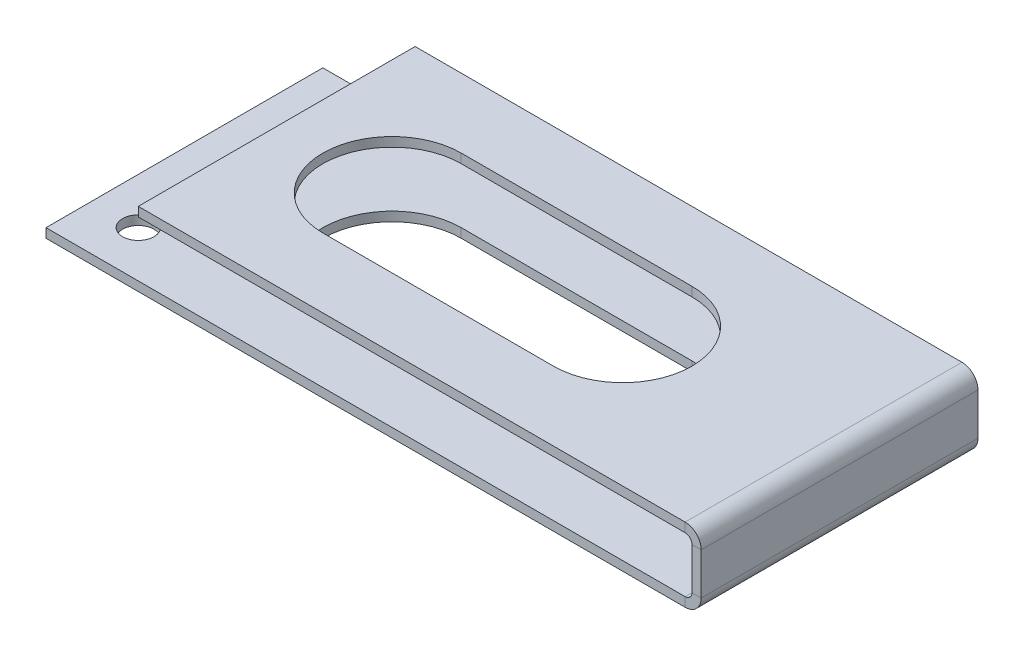
ISO-10303-21;
HEADER;
FILE_DESCRIPTION(('STEP AP214'),'2;1');
FILE_NAME('part.step','',(''),(''),'','','');
FILE_SCHEMA(('AUTOMOTIVE_DESIGN { 1 0 10303 214 1 1 1 1 }'));
ENDSEC;
DATA;
#1=APPLICATION_CONTEXT('core data for automotive mechanical design processes');
#2=APPLICATION_PROTOCOL_DEFINITION('international standard','automotive_design',2000,#1);
#3=PRODUCT_CONTEXT('',#1,'mechanical');
#4=PRODUCT('Part','Part','',(#3));
#5=PRODUCT_RELATED_PRODUCT_CATEGORY('part','',(#4));
#6=PRODUCT_DEFINITION_FORMATION('','',#4);
#7=PRODUCT_DEFINITION_CONTEXT('part definition',#1,'design');
#8=PRODUCT_DEFINITION('design','',#6,#7);
#9=PRODUCT_DEFINITION_SHAPE('','',#8);
#10=(LENGTH_UNIT() NAMED_UNIT(*) SI_UNIT(.MILLI.,.METRE.));
#11=(NAMED_UNIT(*) PLANE_ANGLE_UNIT() SI_UNIT($,.RADIAN.));
#12=(NAMED_UNIT(*) SI_UNIT($,.STERADIAN.) SOLID_ANGLE_UNIT());
#13=UNCERTAINTY_MEASURE_WITH_UNIT(LENGTH_MEASURE(1.E-05),#10,'distance_accuracy_value','');
#14=(GEOMETRIC_REPRESENTATION_CONTEXT(3) GLOBAL_UNCERTAINTY_ASSIGNED_CONTEXT((#13)) GLOBAL_UNIT_ASSIGNED_CONTEXT((#10,
#11,#12)) REPRESENTATION_CONTEXT('',''));
#15=CARTESIAN_POINT('',(0.,0.,0.));
#16=DIRECTION('',(0.,0.,1.));
#17=DIRECTION('',(1.,0.,0.));
#18=AXIS2_PLACEMENT_3D('',#15,#16,#17);
#19=CARTESIAN_POINT('',(31.,-7.,15.));
#20=DIRECTION('',(0.,0.,-1.));
#21=DIRECTION('',(0.,1.,0.));
#22=AXIS2_PLACEMENT_3D('',#19,#20,#21);
#23=PLANE('',#22);
#24=DIRECTION('',(1.,0.,0.));
#25=VECTOR('',#24,1.);
#26=CARTESIAN_POINT('',(30.,-6.26340000000001,15.));
#27=LINE('',#26,#25);
#28=CARTESIAN_POINT('',(30.,-6.26340000000001,15.));
#29=VERTEX_POINT('',#28);
#30=CARTESIAN_POINT('',(31.,-6.2634,15.));
#31=VERTEX_POINT('',#30);
#32=EDGE_CURVE('E274',#29,#31,#27,.T.);
#33=ORIENTED_EDGE('',*,*,#32,.T.);
#34=DIRECTION('',(0.,-1.,0.));
#35=VECTOR('',#34,1.);
#36=CARTESIAN_POINT('',(31.,-7.,15.));
#37=LINE('',#36,#35);
#38=CARTESIAN_POINT('',(31.,-1.73659999999999,15.));
#39=VERTEX_POINT('',#38);
#40=EDGE_CURVE('E302',#39,#31,#37,.T.);
#41=ORIENTED_EDGE('',*,*,#40,.F.);
#42=DIRECTION('',(1.,0.,0.));
#43=VECTOR('',#42,1.);
#44=CARTESIAN_POINT('',(30.,-1.7366,15.));
#45=LINE('',#44,#43);
#46=CARTESIAN_POINT('',(30.,-1.7366,15.));
#47=VERTEX_POINT('',#46);
#48=EDGE_CURVE('E293',#47,#39,#45,.T.);
#49=ORIENTED_EDGE('',*,*,#48,.F.);
#50=DIRECTION('',(0.,-1.,0.));
#51=VECTOR('',#50,1.);
#52=CARTESIAN_POINT('',(30.,-7.,15.));
#53=LINE('',#52,#51);
#54=EDGE_CURVE('E301',#47,#29,#53,.T.);
#55=ORIENTED_EDGE('',*,*,#54,.T.);
#56=EDGE_LOOP('',(#33,#41,#49,#55));
#57=FACE_BOUND('',#56,.T.);
#58=ADVANCED_FACE('F41',(#57),#23,.F.);
#59=CARTESIAN_POINT('',(31.,-0.999999999999997,-15.));
#60=DIRECTION('',(0.,0.,1.));
#61=DIRECTION('',(0.,-1.,0.));
#62=AXIS2_PLACEMENT_3D('',#59,#60,#61);
#63=PLANE('',#62);
#64=DIRECTION('',(1.,0.,0.));
#65=VECTOR('',#64,1.);
#66=CARTESIAN_POINT('',(30.,-6.26340000000001,-15.));
#67=LINE('',#66,#65);
#68=CARTESIAN_POINT('',(30.,-6.26340000000001,-15.));
#69=VERTEX_POINT('',#68);
#70=CARTESIAN_POINT('',(31.,-6.2634,-15.));
#71=VERTEX_POINT('',#70);
#72=EDGE_CURVE('E285',#69,#71,#67,.T.);
#73=ORIENTED_EDGE('',*,*,#72,.F.);
#74=DIRECTION('',(0.,1.,0.));
#75=VECTOR('',#74,1.);
#76=CARTESIAN_POINT('',(30.,-1.,-15.));
#77=LINE('',#76,#75);
#78=CARTESIAN_POINT('',(30.,-1.7366,-15.));
#79=VERTEX_POINT('',#78);
#80=EDGE_CURVE('E305',#69,#79,#77,.T.);
#81=ORIENTED_EDGE('',*,*,#80,.T.);
#82=DIRECTION('',(1.,0.,0.));
#83=VECTOR('',#82,1.);
#84=CARTESIAN_POINT('',(30.,-1.7366,-15.));
#85=LINE('',#84,#83);
#86=CARTESIAN_POINT('',(31.,-1.73659999999999,-15.));
#87=VERTEX_POINT('',#86);
#88=EDGE_CURVE('E288',#79,#87,#85,.T.);
#89=ORIENTED_EDGE('',*,*,#88,.T.);
#90=DIRECTION('',(0.,1.,0.));
#91=VECTOR('',#90,1.);
#92=CARTESIAN_POINT('',(31.,-0.999999999999997,-15.));
#93=LINE('',#92,#91);
#94=EDGE_CURVE('E304',#71,#87,#93,.T.);
#95=ORIENTED_EDGE('',*,*,#94,.F.);
#96=EDGE_LOOP('',(#73,#81,#89,#95));
#97=FACE_BOUND('',#96,.T.);
#98=ADVANCED_FACE('F380',(#97),#63,.F.);
#99=CARTESIAN_POINT('',(31.,1.07574889897452E-13,0.));
#100=DIRECTION('',(-1.,0.,0.));
#101=DIRECTION('',(0.,-1.,0.));
#102=AXIS2_PLACEMENT_3D('',#99,#100,#101);
#103=PLANE('',#102);
#104=DIRECTION('',(0.,0.,1.));
#105=VECTOR('',#104,1.);
#106=CARTESIAN_POINT('',(31.,-6.2634,15.));
#107=LINE('',#106,#105);
#108=EDGE_CURVE('E268',#31,#71,#107,.F.);
#109=ORIENTED_EDGE('',*,*,#108,.T.);
#110=ORIENTED_EDGE('',*,*,#94,.T.);
#111=DIRECTION('',(0.,0.,-1.));
#112=VECTOR('',#111,1.);
#113=CARTESIAN_POINT('',(31.,-1.73659999999999,0.));
#114=LINE('',#113,#112);
#115=EDGE_CURVE('E296',#39,#87,#114,.T.);
#116=ORIENTED_EDGE('',*,*,#115,.F.);
#117=ORIENTED_EDGE('',*,*,#40,.T.);
#118=EDGE_LOOP('',(#109,#110,#116,#117));
#119=FACE_BOUND('',#118,.T.);
#120=ADVANCED_FACE('F386',(#119),#103,.F.);
#121=CARTESIAN_POINT('',(30.,1.04083408558608E-13,0.));
#122=DIRECTION('',(-1.,0.,0.));
#123=DIRECTION('',(0.,-1.,0.));
#124=AXIS2_PLACEMENT_3D('',#121,#122,#123);
#125=PLANE('',#124);
#126=ORIENTED_EDGE('',*,*,#80,.F.);
#127=DIRECTION('',(0.,0.,1.));
#128=VECTOR('',#127,1.);
#129=CARTESIAN_POINT('',(30.,-6.26340000000001,15.));
#130=LINE('',#129,#128);
#131=EDGE_CURVE('E280',#29,#69,#130,.F.);
#132=ORIENTED_EDGE('',*,*,#131,.F.);
#133=ORIENTED_EDGE('',*,*,#54,.F.);
#134=DIRECTION('',(0.,0.,1.));
#135=VECTOR('',#134,1.);
#136=CARTESIAN_POINT('',(30.,-1.7366,-15.));
#137=LINE('',#136,#135);
#138=EDGE_CURVE('E291',#79,#47,#137,.T.);
#139=ORIENTED_EDGE('',*,*,#138,.F.);
#140=EDGE_LOOP('',(#126,#132,#133,#139));
#141=FACE_BOUND('',#140,.T.);
#142=ADVANCED_FACE('F419',(#141),#125,.T.);
#143=CARTESIAN_POINT('',(-30.,-1.,15.));
#144=DIRECTION('',(0.,0.,1.));
#145=DIRECTION('',(1.,0.,0.));
#146=AXIS2_PLACEMENT_3D('',#143,#144,#145);
#147=PLANE('',#146);
#148=DIRECTION('',(1.,0.,0.));
#149=VECTOR('',#148,1.);
#150=CARTESIAN_POINT('',(-30.,-1.,15.));
#151=LINE('',#150,#149);
#152=CARTESIAN_POINT('',(-30.,-1.,15.));
#153=VERTEX_POINT('',#152);
#154=CARTESIAN_POINT('',(29.2634,-1.,15.));
#155=VERTEX_POINT('',#154);
#156=EDGE_CURVE('E339',#153,#155,#151,.T.);
#157=ORIENTED_EDGE('',*,*,#156,.T.);
#158=DIRECTION('',(0.,1.,0.));
#159=VECTOR('',#158,1.);
#160=CARTESIAN_POINT('',(29.2634,-1.,15.));
#161=LINE('',#160,#159);
#162=CARTESIAN_POINT('',(29.2634,0.,15.));
#163=VERTEX_POINT('',#162);
#164=EDGE_CURVE('E317',#155,#163,#161,.T.);
#165=ORIENTED_EDGE('',*,*,#164,.T.);
#166=DIRECTION('',(1.,0.,0.));
#167=VECTOR('',#166,1.);
#168=CARTESIAN_POINT('',(-30.,0.,15.));
#169=LINE('',#168,#167);
#170=CARTESIAN_POINT('',(-30.,0.,15.));
#171=VERTEX_POINT('',#170);
#172=EDGE_CURVE('E336',#171,#163,#169,.T.);
#173=ORIENTED_EDGE('',*,*,#172,.F.);
#174=DIRECTION('',(0.,1.,0.));
#175=VECTOR('',#174,1.);
#176=CARTESIAN_POINT('',(-30.,-1.,15.));
#177=LINE('',#176,#175);
#178=EDGE_CURVE('E349',#153,#171,#177,.T.);
#179=ORIENTED_EDGE('',*,*,#178,.F.);
#180=EDGE_LOOP('',(#157,#165,#173,#179));
#181=FACE_BOUND('',#180,.T.);
#182=ADVANCED_FACE('F412',(#181),#147,.T.);
#183=CARTESIAN_POINT('',(0.,-1.,0.));
#184=DIRECTION('',(0.,-1.,0.));
#185=DIRECTION('',(0.,0.,-1.));
#186=AXIS2_PLACEMENT_3D('',#183,#184,#185);
#187=PLANE('',#186);
#188=CARTESIAN_POINT('',(-17.5,-1.,0.));
#189=DIRECTION('',(0.,-1.,0.));
#190=DIRECTION('',(0.,0.,-1.));
#191=AXIS2_PLACEMENT_3D('',#188,#189,#190);
#192=CIRCLE('',#191,7.5);
#193=CARTESIAN_POINT('',(-17.5,-1.,7.5));
#194=VERTEX_POINT('',#193);
#195=CARTESIAN_POINT('',(-17.5,-1.,-7.5));
#196=VERTEX_POINT('',#195);
#197=EDGE_CURVE('E235',#194,#196,#192,.T.);
#198=ORIENTED_EDGE('',*,*,#197,.F.);
#199=DIRECTION('',(-1.,0.,0.));
#200=VECTOR('',#199,1.);
#201=CARTESIAN_POINT('',(0.,-1.,7.5));
#202=LINE('',#201,#200);
#203=CARTESIAN_POINT('',(7.5,-1.,7.5));
#204=VERTEX_POINT('',#203);
#205=EDGE_CURVE('E223',#204,#194,#202,.T.);
#206=ORIENTED_EDGE('',*,*,#205,.F.);
#207=CARTESIAN_POINT('',(7.5,-1.,0.));
#208=DIRECTION('',(0.,-1.,0.));
#209=DIRECTION('',(0.,0.,-1.));
#210=AXIS2_PLACEMENT_3D('',#207,#208,#209);
#211=CIRCLE('',#210,7.5);
#212=CARTESIAN_POINT('',(7.5,-1.,-7.5));
#213=VERTEX_POINT('',#212);
#214=EDGE_CURVE('E231',#213,#204,#211,.T.);
#215=ORIENTED_EDGE('',*,*,#214,.F.);
#216=DIRECTION('',(1.,0.,0.));
#217=VECTOR('',#216,1.);
#218=CARTESIAN_POINT('',(0.,-1.,-7.5));
#219=LINE('',#218,#217);
#220=EDGE_CURVE('E233',#196,#213,#219,.T.);
#221=ORIENTED_EDGE('',*,*,#220,.F.);
#222=EDGE_LOOP('',(#198,#206,#215,#221));
#223=FACE_BOUND('',#222,.T.);
#224=DIRECTION('',(-1.,0.,0.));
#225=VECTOR('',#224,1.);
#226=CARTESIAN_POINT('',(-30.,-1.,-15.));
#227=LINE('',#226,#225);
#228=CARTESIAN_POINT('',(29.2634,-1.,-15.));
#229=VERTEX_POINT('',#228);
#230=CARTESIAN_POINT('',(-30.,-1.,-15.));
#231=VERTEX_POINT('',#230);
#232=EDGE_CURVE('E333',#229,#231,#227,.T.);
#233=ORIENTED_EDGE('',*,*,#232,.F.);
#234=DIRECTION('',(0.,0.,1.));
#235=VECTOR('',#234,1.);
#236=CARTESIAN_POINT('',(29.2634,-1.,15.));
#237=LINE('',#236,#235);
#238=EDGE_CURVE('E323',#155,#229,#237,.F.);
#239=ORIENTED_EDGE('',*,*,#238,.F.);
#240=ORIENTED_EDGE('',*,*,#156,.F.);
#241=DIRECTION('',(0.,0.,1.));
#242=VECTOR('',#241,1.);
#243=CARTESIAN_POINT('',(-30.,-1.,15.));
#244=LINE('',#243,#242);
#245=EDGE_CURVE('E335',#231,#153,#244,.T.);
#246=ORIENTED_EDGE('',*,*,#245,.F.);
#247=EDGE_LOOP('',(#233,#239,#240,#246));
#248=FACE_BOUND('',#247,.T.);
#249=ADVANCED_FACE('F408',(#223,#248),#187,.T.);
#250=CARTESIAN_POINT('',(0.,0.,0.));
#251=DIRECTION('',(0.,-1.,0.));
#252=DIRECTION('',(0.,0.,-1.));
#253=AXIS2_PLACEMENT_3D('',#250,#251,#252);
#254=PLANE('',#253);
#255=DIRECTION('',(1.,0.,0.));
#256=VECTOR('',#255,1.);
#257=CARTESIAN_POINT('',(-17.5,0.,7.5));
#258=LINE('',#257,#256);
#259=CARTESIAN_POINT('',(-17.5,0.,7.5));
#260=VERTEX_POINT('',#259);
#261=CARTESIAN_POINT('',(7.5,0.,7.5));
#262=VERTEX_POINT('',#261);
#263=EDGE_CURVE('E216',#260,#262,#258,.T.);
#264=ORIENTED_EDGE('',*,*,#263,.F.);
#265=CARTESIAN_POINT('',(-17.5,0.,0.));
#266=DIRECTION('',(0.,1.,0.));
#267=DIRECTION('',(0.,0.,1.));
#268=AXIS2_PLACEMENT_3D('',#265,#266,#267);
#269=CIRCLE('',#268,7.5);
#270=CARTESIAN_POINT('',(-17.5,0.,-7.5));
#271=VERTEX_POINT('',#270);
#272=EDGE_CURVE('E64',#271,#260,#269,.T.);
#273=ORIENTED_EDGE('',*,*,#272,.F.);
#274=DIRECTION('',(-1.,0.,0.));
#275=VECTOR('',#274,1.);
#276=CARTESIAN_POINT('',(-17.5,0.,-7.5));
#277=LINE('',#276,#275);
#278=CARTESIAN_POINT('',(7.5,0.,-7.5));
#279=VERTEX_POINT('',#278);
#280=EDGE_CURVE('E204',#279,#271,#277,.T.);
#281=ORIENTED_EDGE('',*,*,#280,.F.);
#282=CARTESIAN_POINT('',(7.5,0.,0.));
#283=DIRECTION('',(0.,1.,0.));
#284=DIRECTION('',(0.,0.,1.));
#285=AXIS2_PLACEMENT_3D('',#282,#283,#284);
#286=CIRCLE('',#285,7.5);
#287=EDGE_CURVE('E207',#262,#279,#286,.T.);
#288=ORIENTED_EDGE('',*,*,#287,.F.);
#289=EDGE_LOOP('',(#264,#273,#281,#288));
#290=FACE_BOUND('',#289,.T.);
#291=DIRECTION('',(0.,0.,1.));
#292=VECTOR('',#291,1.);
#293=CARTESIAN_POINT('',(29.2634,0.,15.));
#294=LINE('',#293,#292);
#295=CARTESIAN_POINT('',(29.2634,0.,-15.));
#296=VERTEX_POINT('',#295);
#297=EDGE_CURVE('E311',#163,#296,#294,.F.);
#298=ORIENTED_EDGE('',*,*,#297,.T.);
#299=DIRECTION('',(-1.,0.,0.));
#300=VECTOR('',#299,1.);
#301=CARTESIAN_POINT('',(-30.,0.,-15.));
#302=LINE('',#301,#300);
#303=CARTESIAN_POINT('',(-30.,0.,-15.));
#304=VERTEX_POINT('',#303);
#305=EDGE_CURVE('E331',#296,#304,#302,.T.);
#306=ORIENTED_EDGE('',*,*,#305,.T.);
#307=DIRECTION('',(0.,0.,1.));
#308=VECTOR('',#307,1.);
#309=CARTESIAN_POINT('',(-30.,0.,15.));
#310=LINE('',#309,#308);
#311=EDGE_CURVE('E344',#304,#171,#310,.T.);
#312=ORIENTED_EDGE('',*,*,#311,.T.);
#313=ORIENTED_EDGE('',*,*,#172,.T.);
#314=EDGE_LOOP('',(#298,#306,#312,#313));
#315=FACE_BOUND('',#314,.T.);
#316=ADVANCED_FACE('F411',(#290,#315),#254,.F.);
#317=CARTESIAN_POINT('',(-30.,-1.,15.));
#318=DIRECTION('',(-1.,0.,0.));
#319=DIRECTION('',(0.,0.,1.));
#320=AXIS2_PLACEMENT_3D('',#317,#318,#319);
#321=PLANE('',#320);
#322=ORIENTED_EDGE('',*,*,#311,.F.);
#323=DIRECTION('',(0.,1.,0.));
#324=VECTOR('',#323,1.);
#325=CARTESIAN_POINT('',(-30.,-1.,-15.));
#326=LINE('',#325,#324);
#327=EDGE_CURVE('E342',#231,#304,#326,.T.);
#328=ORIENTED_EDGE('',*,*,#327,.F.);
#329=ORIENTED_EDGE('',*,*,#245,.T.);
#330=ORIENTED_EDGE('',*,*,#178,.T.);
#331=EDGE_LOOP('',(#322,#328,#329,#330));
#332=FACE_BOUND('',#331,.T.);
#333=ADVANCED_FACE('F416',(#332),#321,.T.);
#334=CARTESIAN_POINT('',(-30.,-1.,-15.));
#335=DIRECTION('',(0.,0.,-1.));
#336=DIRECTION('',(-1.,0.,0.));
#337=AXIS2_PLACEMENT_3D('',#334,#335,#336);
#338=PLANE('',#337);
#339=DIRECTION('',(0.,1.,0.));
#340=VECTOR('',#339,1.);
#341=CARTESIAN_POINT('',(29.2634,-1.,-15.));
#342=LINE('',#341,#340);
#343=EDGE_CURVE('E328',#229,#296,#342,.T.);
#344=ORIENTED_EDGE('',*,*,#343,.F.);
#345=ORIENTED_EDGE('',*,*,#232,.T.);
#346=ORIENTED_EDGE('',*,*,#327,.T.);
#347=ORIENTED_EDGE('',*,*,#305,.F.);
#348=EDGE_LOOP('',(#344,#345,#346,#347));
#349=FACE_BOUND('',#348,.T.);
#350=ADVANCED_FACE('F43',(#349),#338,.T.);
#351=CARTESIAN_POINT('',(29.2634,-1.7366,-15.));
#352=DIRECTION('',(0.,0.,-1.));
#353=DIRECTION('',(-1.,0.,0.));
#354=AXIS2_PLACEMENT_3D('',#351,#352,#353);
#355=PLANE('',#354);
#356=ORIENTED_EDGE('',*,*,#88,.F.);
#357=CARTESIAN_POINT('',(29.2634,-1.7366,-15.));
#358=DIRECTION('',(0.,0.,1.));
#359=DIRECTION('',(1.,0.,0.));
#360=AXIS2_PLACEMENT_3D('',#357,#358,#359);
#361=CIRCLE('',#360,0.7366);
#362=EDGE_CURVE('E320',#229,#79,#361,.F.);
#363=ORIENTED_EDGE('',*,*,#362,.F.);
#364=ORIENTED_EDGE('',*,*,#343,.T.);
#365=CARTESIAN_POINT('',(29.2634,-1.7366,-15.));
#366=DIRECTION('',(0.,0.,1.));
#367=DIRECTION('',(1.,0.,0.));
#368=AXIS2_PLACEMENT_3D('',#365,#366,#367);
#369=CIRCLE('',#368,1.7366);
#370=EDGE_CURVE('E313',#296,#87,#369,.F.);
#371=ORIENTED_EDGE('',*,*,#370,.T.);
#372=EDGE_LOOP('',(#356,#363,#364,#371));
#373=FACE_BOUND('',#372,.T.);
#374=ADVANCED_FACE('F401',(#373),#355,.T.);
#375=CARTESIAN_POINT('',(29.2634,-1.7366,15.));
#376=DIRECTION('',(0.,0.,-1.));
#377=DIRECTION('',(-1.,0.,0.));
#378=AXIS2_PLACEMENT_3D('',#375,#376,#377);
#379=PLANE('',#378);
#380=CARTESIAN_POINT('',(29.2634,-1.7366,15.));
#381=DIRECTION('',(0.,0.,1.));
#382=DIRECTION('',(1.,0.,0.));
#383=AXIS2_PLACEMENT_3D('',#380,#381,#382);
#384=CIRCLE('',#383,0.7366);
#385=EDGE_CURVE('E307',#47,#155,#384,.T.);
#386=ORIENTED_EDGE('',*,*,#385,.F.);
#387=ORIENTED_EDGE('',*,*,#48,.T.);
#388=CARTESIAN_POINT('',(29.2634,-1.7366,15.));
#389=DIRECTION('',(0.,0.,1.));
#390=DIRECTION('',(1.,0.,0.));
#391=AXIS2_PLACEMENT_3D('',#388,#389,#390);
#392=CIRCLE('',#391,1.7366);
#393=EDGE_CURVE('E314',#39,#163,#392,.T.);
#394=ORIENTED_EDGE('',*,*,#393,.T.);
#395=ORIENTED_EDGE('',*,*,#164,.F.);
#396=EDGE_LOOP('',(#386,#387,#394,#395));
#397=FACE_BOUND('',#396,.T.);
#398=ADVANCED_FACE('F395',(#397),#379,.F.);
#399=CARTESIAN_POINT('',(29.2634,-1.7366,15.));
#400=DIRECTION('',(0.,0.,1.));
#401=DIRECTION('',(1.,0.,0.));
#402=AXIS2_PLACEMENT_3D('',#399,#400,#401);
#403=CYLINDRICAL_SURFACE('',#402,1.7366);
#404=ORIENTED_EDGE('',*,*,#297,.F.);
#405=ORIENTED_EDGE('',*,*,#393,.F.);
#406=ORIENTED_EDGE('',*,*,#115,.T.);
#407=ORIENTED_EDGE('',*,*,#370,.F.);
#408=EDGE_LOOP('',(#404,#405,#406,#407));
#409=FACE_BOUND('',#408,.T.);
#410=ADVANCED_FACE('F391',(#409),#403,.T.);
#411=CARTESIAN_POINT('',(29.2634,-1.7366,15.));
#412=DIRECTION('',(0.,0.,1.));
#413=DIRECTION('',(1.,0.,0.));
#414=AXIS2_PLACEMENT_3D('',#411,#412,#413);
#415=CYLINDRICAL_SURFACE('',#414,0.7366);
#416=ORIENTED_EDGE('',*,*,#238,.T.);
#417=ORIENTED_EDGE('',*,*,#362,.T.);
#418=ORIENTED_EDGE('',*,*,#138,.T.);
#419=ORIENTED_EDGE('',*,*,#385,.T.);
#420=EDGE_LOOP('',(#416,#417,#418,#419));
#421=FACE_BOUND('',#420,.T.);
#422=ADVANCED_FACE('F394',(#421),#415,.F.);
#423=CARTESIAN_POINT('',(29.2634,-6.26340000000001,-15.));
#424=DIRECTION('',(0.,0.,-1.));
#425=DIRECTION('',(-1.,0.,0.));
#426=AXIS2_PLACEMENT_3D('',#423,#424,#425);
#427=PLANE('',#426);
#428=DIRECTION('',(0.,-1.,0.));
#429=VECTOR('',#428,1.);
#430=CARTESIAN_POINT('',(29.2634,-7.00000000000001,-15.));
#431=LINE('',#430,#429);
#432=CARTESIAN_POINT('',(29.2634,-7.00000000000001,-15.));
#433=VERTEX_POINT('',#432);
#434=CARTESIAN_POINT('',(29.2634,-8.00000000000001,-15.));
#435=VERTEX_POINT('',#434);
#436=EDGE_CURVE('E237',#433,#435,#431,.T.);
#437=ORIENTED_EDGE('',*,*,#436,.F.);
#438=CARTESIAN_POINT('',(29.2634,-6.26340000000001,-15.));
#439=DIRECTION('',(0.,0.,1.));
#440=DIRECTION('',(1.,0.,0.));
#441=AXIS2_PLACEMENT_3D('',#438,#439,#440);
#442=CIRCLE('',#441,0.736599999999998);
#443=EDGE_CURVE('E277',#69,#433,#442,.F.);
#444=ORIENTED_EDGE('',*,*,#443,.F.);
#445=ORIENTED_EDGE('',*,*,#72,.T.);
#446=CARTESIAN_POINT('',(29.2634,-6.26340000000001,-15.));
#447=DIRECTION('',(0.,0.,1.));
#448=DIRECTION('',(1.,0.,0.));
#449=AXIS2_PLACEMENT_3D('',#446,#447,#448);
#450=CIRCLE('',#449,1.7366);
#451=EDGE_CURVE('E270',#71,#435,#450,.F.);
#452=ORIENTED_EDGE('',*,*,#451,.T.);
#453=EDGE_LOOP('',(#437,#444,#445,#452));
#454=FACE_BOUND('',#453,.T.);
#455=ADVANCED_FACE('F399',(#454),#427,.T.);
#456=CARTESIAN_POINT('',(29.2634,-6.26340000000001,15.));
#457=DIRECTION('',(0.,0.,-1.));
#458=DIRECTION('',(-1.,0.,0.));
#459=AXIS2_PLACEMENT_3D('',#456,#457,#458);
#460=PLANE('',#459);
#461=CARTESIAN_POINT('',(29.2634,-6.26340000000001,15.));
#462=DIRECTION('',(0.,0.,1.));
#463=DIRECTION('',(1.,0.,0.));
#464=AXIS2_PLACEMENT_3D('',#461,#462,#463);
#465=CIRCLE('',#464,0.736599999999998);
#466=CARTESIAN_POINT('',(29.2634,-7.00000000000001,15.));
#467=VERTEX_POINT('',#466);
#468=EDGE_CURVE('E267',#467,#29,#465,.T.);
#469=ORIENTED_EDGE('',*,*,#468,.F.);
#470=DIRECTION('',(0.,-1.,0.));
#471=VECTOR('',#470,1.);
#472=CARTESIAN_POINT('',(29.2634,-7.00000000000001,15.));
#473=LINE('',#472,#471);
#474=CARTESIAN_POINT('',(29.2634,-8.00000000000001,15.));
#475=VERTEX_POINT('',#474);
#476=EDGE_CURVE('E240',#467,#475,#473,.T.);
#477=ORIENTED_EDGE('',*,*,#476,.T.);
#478=CARTESIAN_POINT('',(29.2634,-6.26340000000001,15.));
#479=DIRECTION('',(0.,0.,1.));
#480=DIRECTION('',(1.,0.,0.));
#481=AXIS2_PLACEMENT_3D('',#478,#479,#480);
#482=CIRCLE('',#481,1.7366);
#483=EDGE_CURVE('E271',#475,#31,#482,.T.);
#484=ORIENTED_EDGE('',*,*,#483,.T.);
#485=ORIENTED_EDGE('',*,*,#32,.F.);
#486=EDGE_LOOP('',(#469,#477,#484,#485));
#487=FACE_BOUND('',#486,.T.);
#488=ADVANCED_FACE('F448',(#487),#460,.F.);
#489=CARTESIAN_POINT('',(29.2634,-6.26340000000001,15.));
#490=DIRECTION('',(0.,0.,1.));
#491=DIRECTION('',(0.,-1.,0.));
#492=AXIS2_PLACEMENT_3D('',#489,#490,#491);
#493=CYLINDRICAL_SURFACE('',#492,1.7366);
#494=ORIENTED_EDGE('',*,*,#108,.F.);
#495=ORIENTED_EDGE('',*,*,#483,.F.);
#496=DIRECTION('',(0.,0.,-1.));
#497=VECTOR('',#496,1.);
#498=CARTESIAN_POINT('',(29.2634,-8.00000000000001,0.));
#499=LINE('',#498,#497);
#500=EDGE_CURVE('E243',#475,#435,#499,.T.);
#501=ORIENTED_EDGE('',*,*,#500,.T.);
#502=ORIENTED_EDGE('',*,*,#451,.F.);
#503=EDGE_LOOP('',(#494,#495,#501,#502));
#504=FACE_BOUND('',#503,.T.);
#505=ADVANCED_FACE('F470',(#504),#493,.T.);
#506=CARTESIAN_POINT('',(29.2634,-6.26340000000001,15.));
#507=DIRECTION('',(0.,0.,1.));
#508=DIRECTION('',(0.,-1.,0.));
#509=AXIS2_PLACEMENT_3D('',#506,#507,#508);
#510=CYLINDRICAL_SURFACE('',#509,0.736599999999998);
#511=ORIENTED_EDGE('',*,*,#131,.T.);
#512=ORIENTED_EDGE('',*,*,#443,.T.);
#513=DIRECTION('',(0.,0.,1.));
#514=VECTOR('',#513,1.);
#515=CARTESIAN_POINT('',(29.2634,-7.00000000000001,-15.));
#516=LINE('',#515,#514);
#517=EDGE_CURVE('E238',#433,#467,#516,.T.);
#518=ORIENTED_EDGE('',*,*,#517,.T.);
#519=ORIENTED_EDGE('',*,*,#468,.T.);
#520=EDGE_LOOP('',(#511,#512,#518,#519));
#521=FACE_BOUND('',#520,.T.);
#522=ADVANCED_FACE('F451',(#521),#510,.F.);
#523=CARTESIAN_POINT('',(-40.,-8.00000000000049,15.));
#524=DIRECTION('',(0.,0.,-1.));
#525=DIRECTION('',(-1.,0.,0.));
#526=AXIS2_PLACEMENT_3D('',#523,#524,#525);
#527=PLANE('',#526);
#528=ORIENTED_EDGE('',*,*,#476,.F.);
#529=DIRECTION('',(-1.,0.,0.));
#530=VECTOR('',#529,1.);
#531=CARTESIAN_POINT('',(-40.,-7.00000000000049,15.));
#532=LINE('',#531,#530);
#533=CARTESIAN_POINT('',(-40.,-7.00000000000049,15.));
#534=VERTEX_POINT('',#533);
#535=EDGE_CURVE('E247',#467,#534,#532,.T.);
#536=ORIENTED_EDGE('',*,*,#535,.T.);
#537=DIRECTION('',(0.,1.,0.));
#538=VECTOR('',#537,1.);
#539=CARTESIAN_POINT('',(-40.,-8.00000000000049,15.));
#540=LINE('',#539,#538);
#541=CARTESIAN_POINT('',(-40.,-8.00000000000049,15.));
#542=VERTEX_POINT('',#541);
#543=EDGE_CURVE('E264',#542,#534,#540,.T.);
#544=ORIENTED_EDGE('',*,*,#543,.F.);
#545=DIRECTION('',(-1.,0.,0.));
#546=VECTOR('',#545,1.);
#547=CARTESIAN_POINT('',(-40.,-8.00000000000049,15.));
#548=LINE('',#547,#546);
#549=EDGE_CURVE('E248',#475,#542,#548,.T.);
#550=ORIENTED_EDGE('',*,*,#549,.F.);
#551=EDGE_LOOP('',(#528,#536,#544,#550));
#552=FACE_BOUND('',#551,.T.);
#553=ADVANCED_FACE('F466',(#552),#527,.F.);
#554=CARTESIAN_POINT('',(30.,-8.,-15.));
#555=DIRECTION('',(0.,0.,1.));
#556=DIRECTION('',(1.,0.,0.));
#557=AXIS2_PLACEMENT_3D('',#554,#555,#556);
#558=PLANE('',#557);
#559=ORIENTED_EDGE('',*,*,#436,.T.);
#560=DIRECTION('',(1.,0.,0.));
#561=VECTOR('',#560,1.);
#562=CARTESIAN_POINT('',(30.,-8.,-15.));
#563=LINE('',#562,#561);
#564=CARTESIAN_POINT('',(-40.,-8.00000000000049,-15.));
#565=VERTEX_POINT('',#564);
#566=EDGE_CURVE('E253',#565,#435,#563,.T.);
#567=ORIENTED_EDGE('',*,*,#566,.F.);
#568=DIRECTION('',(0.,1.,0.));
#569=VECTOR('',#568,1.);
#570=CARTESIAN_POINT('',(-40.,-8.00000000000049,-15.));
#571=LINE('',#570,#569);
#572=CARTESIAN_POINT('',(-40.,-7.00000000000049,-15.));
#573=VERTEX_POINT('',#572);
#574=EDGE_CURVE('E256',#565,#573,#571,.T.);
#575=ORIENTED_EDGE('',*,*,#574,.T.);
#576=DIRECTION('',(1.,0.,0.));
#577=VECTOR('',#576,1.);
#578=CARTESIAN_POINT('',(30.,-7.,-15.));
#579=LINE('',#578,#577);
#580=EDGE_CURVE('E251',#573,#433,#579,.T.);
#581=ORIENTED_EDGE('',*,*,#580,.T.);
#582=EDGE_LOOP('',(#559,#567,#575,#581));
#583=FACE_BOUND('',#582,.T.);
#584=ADVANCED_FACE('F458',(#583),#558,.F.);
#585=CARTESIAN_POINT('',(0.,-8.00000000000021,0.));
#586=DIRECTION('',(0.,1.,0.));
#587=DIRECTION('',(-1.,0.,0.));
#588=AXIS2_PLACEMENT_3D('',#585,#586,#587);
#589=PLANE('',#588);
#590=CARTESIAN_POINT('',(26.,-8.00000000000052,0.));
#591=DIRECTION('',(0.,1.,0.));
#592=DIRECTION('',(-1.,0.,0.));
#593=AXIS2_PLACEMENT_3D('',#590,#591,#592);
#594=CIRCLE('',#593,1.7);
#595=CARTESIAN_POINT('',(24.3,-8.00000000000053,0.));
#596=VERTEX_POINT('',#595);
#597=EDGE_CURVE('E547',#596,#596,#594,.T.);
#598=ORIENTED_EDGE('',*,*,#597,.T.);
#599=EDGE_LOOP('',(#598));
#600=FACE_BOUND('',#599,.T.);
#601=CARTESIAN_POINT('',(-35.,-8.00000000000045,-10.));
#602=DIRECTION('',(0.,1.,0.));
#603=DIRECTION('',(-1.,0.,0.));
#604=AXIS2_PLACEMENT_3D('',#601,#602,#603);
#605=CIRCLE('',#604,1.7);
#606=CARTESIAN_POINT('',(-36.7,-8.00000000000047,-10.));
#607=VERTEX_POINT('',#606);
#608=EDGE_CURVE('E555',#607,#607,#605,.T.);
#609=ORIENTED_EDGE('',*,*,#608,.T.);
#610=EDGE_LOOP('',(#609));
#611=FACE_BOUND('',#610,.T.);
#612=CARTESIAN_POINT('',(-35.,-8.00000000000045,10.));
#613=DIRECTION('',(0.,1.,0.));
#614=DIRECTION('',(1.,0.,0.));
#615=AXIS2_PLACEMENT_3D('',#612,#613,#614);
#616=CIRCLE('',#615,1.7);
#617=CARTESIAN_POINT('',(-33.3,-8.00000000000044,10.));
#618=VERTEX_POINT('',#617);
#619=EDGE_CURVE('E210',#618,#618,#616,.T.);
#620=ORIENTED_EDGE('',*,*,#619,.T.);
#621=EDGE_LOOP('',(#620));
#622=FACE_BOUND('',#621,.T.);
#623=DIRECTION('',(-1.,0.,0.));
#624=VECTOR('',#623,1.);
#625=CARTESIAN_POINT('',(-17.5,-8.00000000000049,-7.5));
#626=LINE('',#625,#624);
#627=CARTESIAN_POINT('',(7.5,-8.00000000000049,-7.5));
#628=VERTEX_POINT('',#627);
#629=CARTESIAN_POINT('',(-17.5,-8.00000000000049,-7.5));
#630=VERTEX_POINT('',#629);
#631=EDGE_CURVE('E203',#628,#630,#626,.T.);
#632=ORIENTED_EDGE('',*,*,#631,.T.);
#633=CARTESIAN_POINT('',(-17.5,-8.00000000000049,0.));
#634=DIRECTION('',(0.,1.,0.));
#635=DIRECTION('',(0.,0.,1.));
#636=AXIS2_PLACEMENT_3D('',#633,#634,#635);
#637=CIRCLE('',#636,7.5);
#638=CARTESIAN_POINT('',(-17.5,-8.00000000000049,7.5));
#639=VERTEX_POINT('',#638);
#640=EDGE_CURVE('E183',#630,#639,#637,.T.);
#641=ORIENTED_EDGE('',*,*,#640,.T.);
#642=DIRECTION('',(1.,0.,0.));
#643=VECTOR('',#642,1.);
#644=CARTESIAN_POINT('',(-17.5,-8.00000000000049,7.5));
#645=LINE('',#644,#643);
#646=CARTESIAN_POINT('',(7.5,-8.00000000000016,7.5));
#647=VERTEX_POINT('',#646);
#648=EDGE_CURVE('E192',#639,#647,#645,.T.);
#649=ORIENTED_EDGE('',*,*,#648,.T.);
#650=CARTESIAN_POINT('',(7.5,-8.00000000000049,0.));
#651=DIRECTION('',(0.,1.,0.));
#652=DIRECTION('',(0.,0.,1.));
#653=AXIS2_PLACEMENT_3D('',#650,#651,#652);
#654=CIRCLE('',#653,7.5);
#655=EDGE_CURVE('E198',#647,#628,#654,.T.);
#656=ORIENTED_EDGE('',*,*,#655,.T.);
#657=EDGE_LOOP('',(#632,#641,#649,#656));
#658=FACE_BOUND('',#657,.T.);
#659=ORIENTED_EDGE('',*,*,#500,.F.);
#660=ORIENTED_EDGE('',*,*,#549,.T.);
#661=DIRECTION('',(0.,0.,-1.));
#662=VECTOR('',#661,1.);
#663=CARTESIAN_POINT('',(-40.,-8.00000000000049,-15.));
#664=LINE('',#663,#662);
#665=EDGE_CURVE('E250',#542,#565,#664,.T.);
#666=ORIENTED_EDGE('',*,*,#665,.T.);
#667=ORIENTED_EDGE('',*,*,#566,.T.);
#668=EDGE_LOOP('',(#659,#660,#666,#667));
#669=FACE_BOUND('',#668,.T.);
#670=ADVANCED_FACE('F200',(#600,#611,#622,#658,#669),#589,.F.);
#671=CARTESIAN_POINT('',(0.,-7.00000000000021,0.));
#672=DIRECTION('',(0.,1.,0.));
#673=DIRECTION('',(-1.,0.,0.));
#674=AXIS2_PLACEMENT_3D('',#671,#672,#673);
#675=PLANE('',#674);
#676=CARTESIAN_POINT('',(26.,-7.00000000000003,0.));
#677=DIRECTION('',(0.,1.,0.));
#678=DIRECTION('',(-1.,0.,0.));
#679=AXIS2_PLACEMENT_3D('',#676,#677,#678);
#680=CIRCLE('',#679,1.7);
#681=CARTESIAN_POINT('',(24.3,-7.00000000000004,0.));
#682=VERTEX_POINT('',#681);
#683=EDGE_CURVE('E550',#682,#682,#680,.T.);
#684=ORIENTED_EDGE('',*,*,#683,.F.);
#685=EDGE_LOOP('',(#684));
#686=FACE_BOUND('',#685,.T.);
#687=CARTESIAN_POINT('',(-35.,-7.00000000000045,-10.));
#688=DIRECTION('',(0.,1.,0.));
#689=DIRECTION('',(-1.,0.,0.));
#690=AXIS2_PLACEMENT_3D('',#687,#688,#689);
#691=CIRCLE('',#690,1.7);
#692=CARTESIAN_POINT('',(-36.7,-7.00000000000047,-10.));
#693=VERTEX_POINT('',#692);
#694=EDGE_CURVE('E217',#693,#693,#691,.T.);
#695=ORIENTED_EDGE('',*,*,#694,.F.);
#696=EDGE_LOOP('',(#695));
#697=FACE_BOUND('',#696,.T.);
#698=CARTESIAN_POINT('',(-35.,-7.00000000000045,10.));
#699=DIRECTION('',(0.,1.,0.));
#700=DIRECTION('',(-1.,0.,0.));
#701=AXIS2_PLACEMENT_3D('',#698,#699,#700);
#702=CIRCLE('',#701,1.7);
#703=CARTESIAN_POINT('',(-36.7,-7.00000000000047,10.));
#704=VERTEX_POINT('',#703);
#705=EDGE_CURVE('E552',#704,#704,#702,.T.);
#706=ORIENTED_EDGE('',*,*,#705,.F.);
#707=EDGE_LOOP('',(#706));
#708=FACE_BOUND('',#707,.T.);
#709=CARTESIAN_POINT('',(-17.5,-7.00000000000033,0.));
#710=DIRECTION('',(0.,1.,0.));
#711=DIRECTION('',(-1.,0.,0.));
#712=AXIS2_PLACEMENT_3D('',#709,#710,#711);
#713=CIRCLE('',#712,7.5);
#714=CARTESIAN_POINT('',(-17.5,-7.00000000000024,-7.5));
#715=VERTEX_POINT('',#714);
#716=CARTESIAN_POINT('',(-17.5,-7.00000000000033,7.5));
#717=VERTEX_POINT('',#716);
#718=EDGE_CURVE('E11',#715,#717,#713,.T.);
#719=ORIENTED_EDGE('',*,*,#718,.F.);
#720=DIRECTION('',(-1.,0.,0.));
#721=VECTOR('',#720,1.);
#722=CARTESIAN_POINT('',(0.,-7.00000000000021,-7.5));
#723=LINE('',#722,#721);
#724=CARTESIAN_POINT('',(7.5,-7.00000000000021,-7.5));
#725=VERTEX_POINT('',#724);
#726=EDGE_CURVE('E49',#725,#715,#723,.T.);
#727=ORIENTED_EDGE('',*,*,#726,.F.);
#728=CARTESIAN_POINT('',(7.5,-7.00000000000016,0.));
#729=DIRECTION('',(0.,1.,0.));
#730=DIRECTION('',(-1.,0.,0.));
#731=AXIS2_PLACEMENT_3D('',#728,#729,#730);
#732=CIRCLE('',#731,7.5);
#733=CARTESIAN_POINT('',(7.5,-7.00000000000024,7.5));
#734=VERTEX_POINT('',#733);
#735=EDGE_CURVE('E355',#734,#725,#732,.T.);
#736=ORIENTED_EDGE('',*,*,#735,.F.);
#737=DIRECTION('',(1.,0.,0.));
#738=VECTOR('',#737,1.);
#739=CARTESIAN_POINT('',(0.,-7.00000000000021,7.5));
#740=LINE('',#739,#738);
#741=EDGE_CURVE('E351',#717,#734,#740,.T.);
#742=ORIENTED_EDGE('',*,*,#741,.F.);
#743=EDGE_LOOP('',(#719,#727,#736,#742));
#744=FACE_BOUND('',#743,.T.);
#745=ORIENTED_EDGE('',*,*,#535,.F.);
#746=ORIENTED_EDGE('',*,*,#517,.F.);
#747=ORIENTED_EDGE('',*,*,#580,.F.);
#748=DIRECTION('',(0.,0.,-1.));
#749=VECTOR('',#748,1.);
#750=CARTESIAN_POINT('',(-40.,-7.00000000000049,-15.));
#751=LINE('',#750,#749);
#752=EDGE_CURVE('E258',#534,#573,#751,.T.);
#753=ORIENTED_EDGE('',*,*,#752,.F.);
#754=EDGE_LOOP('',(#745,#746,#747,#753));
#755=FACE_BOUND('',#754,.T.);
#756=ADVANCED_FACE('F361',(#686,#697,#708,#744,#755),#675,.T.);
#757=CARTESIAN_POINT('',(-40.,-8.00000000000049,-15.));
#758=DIRECTION('',(1.,0.,0.));
#759=DIRECTION('',(0.,1.,0.));
#760=AXIS2_PLACEMENT_3D('',#757,#758,#759);
#761=PLANE('',#760);
#762=ORIENTED_EDGE('',*,*,#752,.T.);
#763=ORIENTED_EDGE('',*,*,#574,.F.);
#764=ORIENTED_EDGE('',*,*,#665,.F.);
#765=ORIENTED_EDGE('',*,*,#543,.T.);
#766=EDGE_LOOP('',(#762,#763,#764,#765));
#767=FACE_BOUND('',#766,.T.);
#768=ADVANCED_FACE('F374',(#767),#761,.F.);
#769=CARTESIAN_POINT('',(-17.5,-8.00000000000049,7.5));
#770=DIRECTION('',(0.,0.,1.));
#771=DIRECTION('',(1.,0.,0.));
#772=AXIS2_PLACEMENT_3D('',#769,#770,#771);
#773=PLANE('',#772);
#774=ORIENTED_EDGE('',*,*,#741,.T.);
#775=DIRECTION('',(0.,1.,0.));
#776=VECTOR('',#775,1.);
#777=CARTESIAN_POINT('',(7.5,-8.00000000000049,7.5));
#778=LINE('',#777,#776);
#779=EDGE_CURVE('E195',#647,#734,#778,.T.);
#780=ORIENTED_EDGE('',*,*,#779,.F.);
#781=ORIENTED_EDGE('',*,*,#648,.F.);
#782=DIRECTION('',(0.,1.,0.));
#783=VECTOR('',#782,1.);
#784=CARTESIAN_POINT('',(-17.5,-8.00000000000049,7.5));
#785=LINE('',#784,#783);
#786=EDGE_CURVE('E178',#639,#717,#785,.T.);
#787=ORIENTED_EDGE('',*,*,#786,.T.);
#788=EDGE_LOOP('',(#774,#780,#781,#787));
#789=FACE_BOUND('',#788,.T.);
#790=ADVANCED_FACE('F193',(#789),#773,.F.);
#791=CARTESIAN_POINT('',(7.5,-8.00000000000049,0.));
#792=DIRECTION('',(0.,1.,0.));
#793=DIRECTION('',(0.,0.,1.));
#794=AXIS2_PLACEMENT_3D('',#791,#792,#793);
#795=CYLINDRICAL_SURFACE('',#794,7.5);
#796=ORIENTED_EDGE('',*,*,#735,.T.);
#797=DIRECTION('',(0.,1.,0.));
#798=VECTOR('',#797,1.);
#799=CARTESIAN_POINT('',(7.5,-8.00000000000049,-7.5));
#800=LINE('',#799,#798);
#801=EDGE_CURVE('E225',#628,#725,#800,.T.);
#802=ORIENTED_EDGE('',*,*,#801,.F.);
#803=ORIENTED_EDGE('',*,*,#655,.F.);
#804=ORIENTED_EDGE('',*,*,#779,.T.);
#805=EDGE_LOOP('',(#796,#802,#803,#804));
#806=FACE_BOUND('',#805,.T.);
#807=ADVANCED_FACE('F364',(#806),#795,.F.);
#808=CARTESIAN_POINT('',(-17.5,-8.00000000000049,-7.5));
#809=DIRECTION('',(0.,0.,-1.));
#810=DIRECTION('',(-1.,0.,0.));
#811=AXIS2_PLACEMENT_3D('',#808,#809,#810);
#812=PLANE('',#811);
#813=ORIENTED_EDGE('',*,*,#726,.T.);
#814=DIRECTION('',(0.,1.,0.));
#815=VECTOR('',#814,1.);
#816=CARTESIAN_POINT('',(-17.5,-8.00000000000049,-7.5));
#817=LINE('',#816,#815);
#818=EDGE_CURVE('E221',#630,#715,#817,.T.);
#819=ORIENTED_EDGE('',*,*,#818,.F.);
#820=ORIENTED_EDGE('',*,*,#631,.F.);
#821=ORIENTED_EDGE('',*,*,#801,.T.);
#822=EDGE_LOOP('',(#813,#819,#820,#821));
#823=FACE_BOUND('',#822,.T.);
#824=ADVANCED_FACE('F358',(#823),#812,.F.);
#825=CARTESIAN_POINT('',(-17.5,-8.00000000000049,0.));
#826=DIRECTION('',(0.,1.,0.));
#827=DIRECTION('',(0.,0.,1.));
#828=AXIS2_PLACEMENT_3D('',#825,#826,#827);
#829=CYLINDRICAL_SURFACE('',#828,7.5);
#830=ORIENTED_EDGE('',*,*,#718,.T.);
#831=ORIENTED_EDGE('',*,*,#786,.F.);
#832=ORIENTED_EDGE('',*,*,#640,.F.);
#833=ORIENTED_EDGE('',*,*,#818,.T.);
#834=EDGE_LOOP('',(#830,#831,#832,#833));
#835=FACE_BOUND('',#834,.T.);
#836=ADVANCED_FACE('F180',(#835),#829,.F.);
#837=ORIENTED_EDGE('',*,*,#197,.T.);
#838=EDGE_CURVE('E224',#196,#271,#817,.T.);
#839=ORIENTED_EDGE('',*,*,#838,.T.);
#840=ORIENTED_EDGE('',*,*,#272,.T.);
#841=EDGE_CURVE('E188',#194,#260,#785,.T.);
#842=ORIENTED_EDGE('',*,*,#841,.F.);
#843=EDGE_LOOP('',(#837,#839,#840,#842));
#844=FACE_BOUND('',#843,.T.);
#845=ADVANCED_FACE('F506',(#844),#829,.F.);
#846=ORIENTED_EDGE('',*,*,#220,.T.);
#847=EDGE_CURVE('E228',#213,#279,#800,.T.);
#848=ORIENTED_EDGE('',*,*,#847,.T.);
#849=ORIENTED_EDGE('',*,*,#280,.T.);
#850=ORIENTED_EDGE('',*,*,#838,.F.);
#851=EDGE_LOOP('',(#846,#848,#849,#850));
#852=FACE_BOUND('',#851,.T.);
#853=ADVANCED_FACE('F373',(#852),#812,.F.);
#854=ORIENTED_EDGE('',*,*,#214,.T.);
#855=EDGE_CURVE('E56',#204,#262,#778,.T.);
#856=ORIENTED_EDGE('',*,*,#855,.T.);
#857=ORIENTED_EDGE('',*,*,#287,.T.);
#858=ORIENTED_EDGE('',*,*,#847,.F.);
#859=EDGE_LOOP('',(#854,#856,#857,#858));
#860=FACE_BOUND('',#859,.T.);
#861=ADVANCED_FACE('F367',(#860),#795,.F.);
#862=ORIENTED_EDGE('',*,*,#205,.T.);
#863=ORIENTED_EDGE('',*,*,#841,.T.);
#864=ORIENTED_EDGE('',*,*,#263,.T.);
#865=ORIENTED_EDGE('',*,*,#855,.F.);
#866=EDGE_LOOP('',(#862,#863,#864,#865));
#867=FACE_BOUND('',#866,.T.);
#868=ADVANCED_FACE('F376',(#867),#773,.F.);
#869=CARTESIAN_POINT('',(-35.,0.00100000000003396,10.));
#870=DIRECTION('',(0.,-1.,0.));
#871=DIRECTION('',(1.,0.,0.));
#872=AXIS2_PLACEMENT_3D('',#869,#870,#871);
#873=CYLINDRICAL_SURFACE('',#872,1.7);
#874=ORIENTED_EDGE('',*,*,#705,.T.);
#875=EDGE_LOOP('',(#874));
#876=FACE_BOUND('',#875,.T.);
#877=ORIENTED_EDGE('',*,*,#619,.F.);
#878=EDGE_LOOP('',(#877));
#879=FACE_BOUND('',#878,.T.);
#880=ADVANCED_FACE('F524',(#876,#879),#873,.F.);
#881=CARTESIAN_POINT('',(-35.,0.00100000000003396,-10.));
#882=DIRECTION('',(0.,-1.,0.));
#883=DIRECTION('',(1.,0.,0.));
#884=AXIS2_PLACEMENT_3D('',#881,#882,#883);
#885=CYLINDRICAL_SURFACE('',#884,1.7);
#886=ORIENTED_EDGE('',*,*,#694,.T.);
#887=EDGE_LOOP('',(#886));
#888=FACE_BOUND('',#887,.T.);
#889=ORIENTED_EDGE('',*,*,#608,.F.);
#890=EDGE_LOOP('',(#889));
#891=FACE_BOUND('',#890,.T.);
#892=ADVANCED_FACE('F528',(#888,#891),#885,.F.);
#893=CARTESIAN_POINT('',(26.,-8.00000000000052,0.));
#894=DIRECTION('',(0.,1.,0.));
#895=DIRECTION('',(-1.,0.,0.));
#896=AXIS2_PLACEMENT_3D('',#893,#894,#895);
#897=CYLINDRICAL_SURFACE('',#896,1.7);
#898=ORIENTED_EDGE('',*,*,#597,.F.);
#899=EDGE_LOOP('',(#898));
#900=FACE_BOUND('',#899,.T.);
#901=ORIENTED_EDGE('',*,*,#683,.T.);
#902=EDGE_LOOP('',(#901));
#903=FACE_BOUND('',#902,.T.);
#904=ADVANCED_FACE('F534',(#900,#903),#897,.F.);
#905=CLOSED_SHELL('',(#58,#98,#120,#142,#182,#249,#316,#333,#350,#374,#398,#410,#422,#455,#488,
#505,#522,#553,#584,#670,#756,#768,#790,#807,#824,#836,#845,#853,#861,#868,#880,#892,#904));
#906=MANIFOLD_SOLID_BREP('B2',#905);
#907=ADVANCED_BREP_SHAPE_REPRESENTATION('',(#18,#906),#14);
#908=SHAPE_DEFINITION_REPRESENTATION(#9,#907);
ENDSEC;
END-ISO-10303-21;
